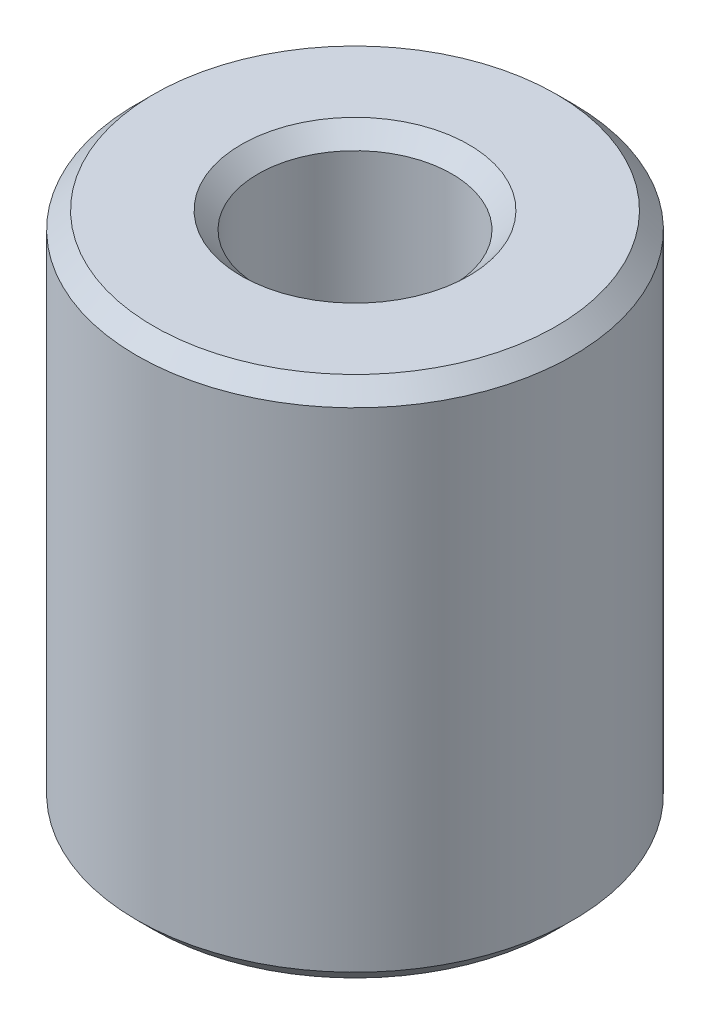
ISO-10303-21;
HEADER;
FILE_DESCRIPTION(('STEP AP214'),'2;1');
FILE_NAME('part.step','',(''),(''),'','','');
FILE_SCHEMA(('AUTOMOTIVE_DESIGN { 1 0 10303 214 1 1 1 1 }'));
ENDSEC;
DATA;
#1=APPLICATION_CONTEXT('core data for automotive mechanical design processes');
#2=APPLICATION_PROTOCOL_DEFINITION('international standard','automotive_design',2000,#1);
#3=PRODUCT_CONTEXT('',#1,'mechanical');
#4=PRODUCT('Part','Part','',(#3));
#5=PRODUCT_RELATED_PRODUCT_CATEGORY('part','',(#4));
#6=PRODUCT_DEFINITION_FORMATION('','',#4);
#7=PRODUCT_DEFINITION_CONTEXT('part definition',#1,'design');
#8=PRODUCT_DEFINITION('design','',#6,#7);
#9=PRODUCT_DEFINITION_SHAPE('','',#8);
#10=(LENGTH_UNIT() NAMED_UNIT(*) SI_UNIT(.MILLI.,.METRE.));
#11=(NAMED_UNIT(*) PLANE_ANGLE_UNIT() SI_UNIT($,.RADIAN.));
#12=(NAMED_UNIT(*) SI_UNIT($,.STERADIAN.) SOLID_ANGLE_UNIT());
#13=UNCERTAINTY_MEASURE_WITH_UNIT(LENGTH_MEASURE(1.E-05),#10,'distance_accuracy_value','');
#14=(GEOMETRIC_REPRESENTATION_CONTEXT(3) GLOBAL_UNCERTAINTY_ASSIGNED_CONTEXT((#13)) GLOBAL_UNIT_ASSIGNED_CONTEXT((#10,
#11,#12)) REPRESENTATION_CONTEXT('',''));
#15=CARTESIAN_POINT('',(0.,0.,0.));
#16=DIRECTION('',(0.,0.,1.));
#17=DIRECTION('',(1.,0.,0.));
#18=AXIS2_PLACEMENT_3D('',#15,#16,#17);
#19=CARTESIAN_POINT('',(0.,23.967323460707,0.));
#20=DIRECTION('',(0.,-1.,0.));
#21=DIRECTION('',(0.,0.,-1.));
#22=AXIS2_PLACEMENT_3D('',#19,#20,#21);
#23=CYLINDRICAL_SURFACE('',#22,10.);
#24=CARTESIAN_POINT('',(0.,0.775910704155915,0.));
#25=DIRECTION('',(0.,1.,0.));
#26=DIRECTION('',(0.,0.,1.));
#27=AXIS2_PLACEMENT_3D('',#24,#25,#26);
#28=CIRCLE('',#27,10.);
#29=CARTESIAN_POINT('',(0.,0.775910704155915,10.));
#30=VERTEX_POINT('',#29);
#31=EDGE_CURVE('E10',#30,#30,#28,.T.);
#32=ORIENTED_EDGE('',*,*,#31,.T.);
#33=EDGE_LOOP('',(#32));
#34=FACE_BOUND('',#33,.T.);
#35=CARTESIAN_POINT('',(0.,23.1914127565511,0.));
#36=DIRECTION('',(0.,1.,0.));
#37=DIRECTION('',(0.,0.,1.));
#38=AXIS2_PLACEMENT_3D('',#35,#36,#37);
#39=CIRCLE('',#38,10.);
#40=CARTESIAN_POINT('',(0.,23.1914127565511,-10.));
#41=VERTEX_POINT('',#40);
#42=EDGE_CURVE('E50',#41,#41,#39,.F.);
#43=ORIENTED_EDGE('',*,*,#42,.T.);
#44=EDGE_LOOP('',(#43));
#45=FACE_BOUND('',#44,.T.);
#46=ADVANCED_FACE('F39',(#34,#45),#23,.T.);
#47=CARTESIAN_POINT('',(0.,23.967323460707,0.));
#48=DIRECTION('',(0.,1.,0.));
#49=DIRECTION('',(0.,0.,1.));
#50=AXIS2_PLACEMENT_3D('',#47,#48,#49);
#51=PLANE('',#50);
#52=CARTESIAN_POINT('',(0.,23.967323460707,0.));
#53=DIRECTION('',(0.,1.,0.));
#54=DIRECTION('',(0.,0.,1.));
#55=AXIS2_PLACEMENT_3D('',#52,#53,#54);
#56=CIRCLE('',#55,5.21880185330139);
#57=CARTESIAN_POINT('',(0.,23.967323460707,5.21880185330139));
#58=VERTEX_POINT('',#57);
#59=EDGE_CURVE('E58',#58,#58,#56,.F.);
#60=ORIENTED_EDGE('',*,*,#59,.T.);
#61=EDGE_LOOP('',(#60));
#62=FACE_BOUND('',#61,.T.);
#63=CARTESIAN_POINT('',(0.,23.967323460707,0.));
#64=DIRECTION('',(0.,1.,0.));
#65=DIRECTION('',(0.,0.,1.));
#66=AXIS2_PLACEMENT_3D('',#63,#64,#65);
#67=CIRCLE('',#66,9.22408929584409);
#68=CARTESIAN_POINT('',(0.,23.967323460707,-9.22408929584409));
#69=VERTEX_POINT('',#68);
#70=EDGE_CURVE('E61',#69,#69,#67,.T.);
#71=ORIENTED_EDGE('',*,*,#70,.T.);
#72=EDGE_LOOP('',(#71));
#73=FACE_BOUND('',#72,.T.);
#74=ADVANCED_FACE('F88',(#62,#73),#51,.T.);
#75=CARTESIAN_POINT('',(0.,0.,0.));
#76=DIRECTION('',(0.,1.,0.));
#77=DIRECTION('',(0.,0.,1.));
#78=AXIS2_PLACEMENT_3D('',#75,#76,#77);
#79=PLANE('',#78);
#80=CARTESIAN_POINT('',(0.,0.,0.));
#81=DIRECTION('',(0.,1.,0.));
#82=DIRECTION('',(0.,0.,1.));
#83=AXIS2_PLACEMENT_3D('',#80,#81,#82);
#84=CIRCLE('',#83,5.21880185330138);
#85=CARTESIAN_POINT('',(0.,0.,5.21880185330138));
#86=VERTEX_POINT('',#85);
#87=EDGE_CURVE('E51',#86,#86,#84,.T.);
#88=ORIENTED_EDGE('',*,*,#87,.T.);
#89=EDGE_LOOP('',(#88));
#90=FACE_BOUND('',#89,.T.);
#91=CARTESIAN_POINT('',(0.,0.,0.));
#92=DIRECTION('',(0.,1.,0.));
#93=DIRECTION('',(0.,0.,1.));
#94=AXIS2_PLACEMENT_3D('',#91,#92,#93);
#95=CIRCLE('',#94,9.22408929584408);
#96=CARTESIAN_POINT('',(0.,0.,9.22408929584408));
#97=VERTEX_POINT('',#96);
#98=EDGE_CURVE('E54',#97,#97,#95,.F.);
#99=ORIENTED_EDGE('',*,*,#98,.T.);
#100=EDGE_LOOP('',(#99));
#101=FACE_BOUND('',#100,.T.);
#102=ADVANCED_FACE('F83',(#90,#101),#79,.F.);
#103=CARTESIAN_POINT('',(0.,23.967323460707,0.));
#104=DIRECTION('',(0.,-1.,0.));
#105=DIRECTION('',(0.,0.,-1.));
#106=AXIS2_PLACEMENT_3D('',#103,#104,#105);
#107=CYLINDRICAL_SURFACE('',#106,4.44289114914546);
#108=CARTESIAN_POINT('',(0.,23.1914127565511,0.));
#109=DIRECTION('',(0.,1.,0.));
#110=DIRECTION('',(0.,0.,1.));
#111=AXIS2_PLACEMENT_3D('',#108,#109,#110);
#112=CIRCLE('',#111,4.44289114914546);
#113=CARTESIAN_POINT('',(0.,23.1914127565511,4.44289114914546));
#114=VERTEX_POINT('',#113);
#115=EDGE_CURVE('E67',#114,#114,#112,.T.);
#116=ORIENTED_EDGE('',*,*,#115,.T.);
#117=EDGE_LOOP('',(#116));
#118=FACE_BOUND('',#117,.T.);
#119=CARTESIAN_POINT('',(0.,0.775910704155915,0.));
#120=DIRECTION('',(0.,1.,0.));
#121=DIRECTION('',(0.,0.,1.));
#122=AXIS2_PLACEMENT_3D('',#119,#120,#121);
#123=CIRCLE('',#122,4.44289114914546);
#124=CARTESIAN_POINT('',(0.,0.775910704155915,4.44289114914546));
#125=VERTEX_POINT('',#124);
#126=EDGE_CURVE('E69',#125,#125,#123,.F.);
#127=ORIENTED_EDGE('',*,*,#126,.T.);
#128=EDGE_LOOP('',(#127));
#129=FACE_BOUND('',#128,.T.);
#130=ADVANCED_FACE('F71',(#118,#129),#107,.F.);
#131=CARTESIAN_POINT('',(0.,23.1914127565511,0.));
#132=DIRECTION('',(0.,1.,0.));
#133=DIRECTION('',(0.,0.,1.));
#134=AXIS2_PLACEMENT_3D('',#131,#132,#133);
#135=CONICAL_SURFACE('',#134,4.44289114914546,0.785398163397455);
#136=ORIENTED_EDGE('',*,*,#59,.F.);
#137=EDGE_LOOP('',(#136));
#138=FACE_BOUND('',#137,.T.);
#139=ORIENTED_EDGE('',*,*,#115,.F.);
#140=EDGE_LOOP('',(#139));
#141=FACE_BOUND('',#140,.T.);
#142=ADVANCED_FACE('F77',(#138,#141),#135,.F.);
#143=CARTESIAN_POINT('',(0.,0.,0.));
#144=DIRECTION('',(0.,-1.,0.));
#145=DIRECTION('',(0.,0.,-1.));
#146=AXIS2_PLACEMENT_3D('',#143,#144,#145);
#147=CONICAL_SURFACE('',#146,5.21880185330138,0.785398163397448);
#148=ORIENTED_EDGE('',*,*,#126,.F.);
#149=EDGE_LOOP('',(#148));
#150=FACE_BOUND('',#149,.T.);
#151=ORIENTED_EDGE('',*,*,#87,.F.);
#152=EDGE_LOOP('',(#151));
#153=FACE_BOUND('',#152,.T.);
#154=ADVANCED_FACE('F73',(#150,#153),#147,.F.);
#155=CARTESIAN_POINT('',(0.,0.775910704155915,0.));
#156=DIRECTION('',(0.,1.,0.));
#157=DIRECTION('',(0.,0.,1.));
#158=AXIS2_PLACEMENT_3D('',#155,#156,#157);
#159=CONICAL_SURFACE('',#158,10.,0.785398163397453);
#160=ORIENTED_EDGE('',*,*,#98,.F.);
#161=EDGE_LOOP('',(#160));
#162=FACE_BOUND('',#161,.T.);
#163=ORIENTED_EDGE('',*,*,#31,.F.);
#164=EDGE_LOOP('',(#163));
#165=FACE_BOUND('',#164,.T.);
#166=ADVANCED_FACE('F76',(#162,#165),#159,.T.);
#167=CARTESIAN_POINT('',(0.,23.967323460707,0.));
#168=DIRECTION('',(0.,-1.,0.));
#169=DIRECTION('',(0.,0.,-1.));
#170=AXIS2_PLACEMENT_3D('',#167,#168,#169);
#171=CONICAL_SURFACE('',#170,9.22408929584409,0.785398163397442);
#172=CARTESIAN_POINT('',(0.,23.1914127565511,-10.));
#173=CARTESIAN_POINT('',(0.,23.1994951597194,-9.99191759683171));
#174=CARTESIAN_POINT('',(0.,23.2075775628877,-9.98383519366342));
#175=CARTESIAN_POINT('',(0.,23.2237423692243,-9.96767038732684));
#176=CARTESIAN_POINT('',(0.,23.2318247723925,-9.95958798415855));
#177=CARTESIAN_POINT('',(0.,23.2479895787291,-9.94342317782197));
#178=CARTESIAN_POINT('',(0.,23.2560719818974,-9.93534077465368));
#179=CARTESIAN_POINT('',(0.,23.272236788234,-9.9191759683171));
#180=CARTESIAN_POINT('',(0.,23.2803191914023,-9.91109356514881));
#181=CARTESIAN_POINT('',(0.,23.2964839977389,-9.89492875881223));
#182=CARTESIAN_POINT('',(0.,23.3045664009072,-9.88684635564393));
#183=CARTESIAN_POINT('',(0.,23.3207312072437,-9.87068154930735));
#184=CARTESIAN_POINT('',(0.,23.328813610412,-9.86259914613906));
#185=CARTESIAN_POINT('',(0.,23.3449784167486,-9.84643433980248));
#186=CARTESIAN_POINT('',(0.,23.3530608199169,-9.83835193663419));
#187=CARTESIAN_POINT('',(0.,23.3692256262535,-9.82218713029761));
#188=CARTESIAN_POINT('',(0.,23.3773080294218,-9.81410472712932));
#189=CARTESIAN_POINT('',(0.,23.3934728357584,-9.79793992079274));
#190=CARTESIAN_POINT('',(0.,23.4015552389267,-9.78985751762445));
#191=CARTESIAN_POINT('',(0.,23.4177200452632,-9.77369271128786));
#192=CARTESIAN_POINT('',(0.,23.4258024484315,-9.76561030811957));
#193=CARTESIAN_POINT('',(0.,23.4419672547681,-9.74944550178299));
#194=CARTESIAN_POINT('',(0.,23.4500496579364,-9.7413630986147));
#195=CARTESIAN_POINT('',(0.,23.466214464273,-9.72519829227812));
#196=CARTESIAN_POINT('',(0.,23.4742968674413,-9.71711588910983));
#197=CARTESIAN_POINT('',(0.,23.4904616737779,-9.70095108277325));
#198=CARTESIAN_POINT('',(0.,23.4985440769461,-9.69286867960496));
#199=CARTESIAN_POINT('',(0.,23.5147088832827,-9.67670387326837));
#200=CARTESIAN_POINT('',(0.,23.522791286451,-9.66862147010008));
#201=CARTESIAN_POINT('',(0.,23.5389560927876,-9.6524566637635));
#202=CARTESIAN_POINT('',(0.,23.5470384959559,-9.64437426059521));
#203=CARTESIAN_POINT('',(0.,23.5632033022925,-9.62820945425863));
#204=CARTESIAN_POINT('',(0.,23.5712857054608,-9.62012705109034));
#205=CARTESIAN_POINT('',(0.,23.5874505117973,-9.60396224475376));
#206=CARTESIAN_POINT('',(0.,23.5955329149656,-9.59587984158547));
#207=CARTESIAN_POINT('',(0.,23.6116977213022,-9.57971503524888));
#208=CARTESIAN_POINT('',(0.,23.6197801244705,-9.5716326320806));
#209=CARTESIAN_POINT('',(0.,23.6359449308071,-9.55546782574401));
#210=CARTESIAN_POINT('',(0.,23.6440273339754,-9.54738542257572));
#211=CARTESIAN_POINT('',(0.,23.660192140312,-9.53122061623914));
#212=CARTESIAN_POINT('',(0.,23.6682745434803,-9.52313821307085));
#213=CARTESIAN_POINT('',(0.,23.6844393498168,-9.50697340673427));
#214=CARTESIAN_POINT('',(0.,23.6925217529851,-9.49889100356598));
#215=CARTESIAN_POINT('',(0.,23.7086865593217,-9.4827261972294));
#216=CARTESIAN_POINT('',(0.,23.71676896249,-9.47464379406111));
#217=CARTESIAN_POINT('',(0.,23.7329337688266,-9.45847898772452));
#218=CARTESIAN_POINT('',(0.,23.7410161719949,-9.45039658455623));
#219=CARTESIAN_POINT('',(0.,23.7571809783315,-9.43423177821965));
#220=CARTESIAN_POINT('',(0.,23.7652633814997,-9.42614937505136));
#221=CARTESIAN_POINT('',(0.,23.7814281878363,-9.40998456871478));
#222=CARTESIAN_POINT('',(0.,23.7895105910046,-9.40190216554649));
#223=CARTESIAN_POINT('',(0.,23.8056753973412,-9.38573735920991));
#224=CARTESIAN_POINT('',(0.,23.8137578005095,-9.37765495604162));
#225=CARTESIAN_POINT('',(0.,23.8299226068461,-9.36149014970504));
#226=CARTESIAN_POINT('',(0.,23.8380050100144,-9.35340774653674));
#227=CARTESIAN_POINT('',(0.,23.8541698163509,-9.33724294020016));
#228=CARTESIAN_POINT('',(0.,23.8622522195192,-9.32916053703187));
#229=CARTESIAN_POINT('',(0.,23.8784170258558,-9.31299573069529));
#230=CARTESIAN_POINT('',(0.,23.8864994290241,-9.304913327527));
#231=CARTESIAN_POINT('',(0.,23.9026642353607,-9.28874852119042));
#232=CARTESIAN_POINT('',(0.,23.910746638529,-9.28066611802213));
#233=CARTESIAN_POINT('',(0.,23.9269114448656,-9.26450131168555));
#234=CARTESIAN_POINT('',(0.,23.9349938480339,-9.25641890851725));
#235=CARTESIAN_POINT('',(0.,23.9511586543704,-9.24025410218067));
#236=CARTESIAN_POINT('',(0.,23.9592410575387,-9.23217169901238));
#237=CARTESIAN_POINT('',(0.,23.967323460707,-9.22408929584409));
#238=B_SPLINE_CURVE_WITH_KNOTS('',3,(#172,#173,#174,#175,#176,#177,#178,#179,#180,#181,#182,
#183,#184,#185,#186,#187,#188,#189,#190,#191,#192,#193,#194,#195,#196,#197,#198,#199,#200,#201,
#202,#203,#204,#205,#206,#207,#208,#209,#210,#211,#212,#213,#214,#215,#216,#217,#218,#219,#220,
#221,#222,#223,#224,#225,#226,#227,#228,#229,#230,#231,#232,#233,#234,#235,#236,#237),
.UNSPECIFIED.,.F.,.F.,(4,2,2,2,2,2,2,2,2,2,2,2,2,2,2,2,2,2,2,2,2,2,2,2,2,2,2,2,2,2,2,2,4),(0.,
0.0342907325314925,0.0685814650629861,0.102872197594479,0.137162930125971,0.171453662657462,
0.205744395188955,0.240035127720447,0.274325860251941,0.308616592783433,0.342907325314925,
0.377198057846417,0.411488790377909,0.445779522909403,0.480070255440893,0.514360987972387,
0.548651720503879,0.582942453035372,0.617233185566865,0.651523918098355,0.685814650629848,
0.720105383161342,0.754396115692834,0.788686848224325,0.822977580755818,0.85726831328731,
0.891559045818804,0.925849778350296,0.960140510881786,0.99443124341328,1.02872197594477,
1.06301270847627,1.09730344100776),.UNSPECIFIED.);
#239=EDGE_CURVE('BSEAM45',#41,#69,#238,.T.);
#240=ORIENTED_EDGE('',*,*,#42,.F.);
#241=ORIENTED_EDGE('',*,*,#70,.F.);
#242=ORIENTED_EDGE('',*,*,#239,.T.);
#243=ORIENTED_EDGE('',*,*,#239,.F.);
#244=EDGE_LOOP('',(#240,#242,#241,#243));
#245=FACE_BOUND('',#244,.T.);
#246=ADVANCED_FACE('F45',(#245),#171,.T.);
#247=CLOSED_SHELL('',(#46,#74,#102,#130,#142,#154,#166,#246));
#248=MANIFOLD_SOLID_BREP('B2',#247);
#249=ADVANCED_BREP_SHAPE_REPRESENTATION('',(#18,#248),#14);
#250=SHAPE_DEFINITION_REPRESENTATION(#9,#249);
ENDSEC;
END-ISO-10303-21;
